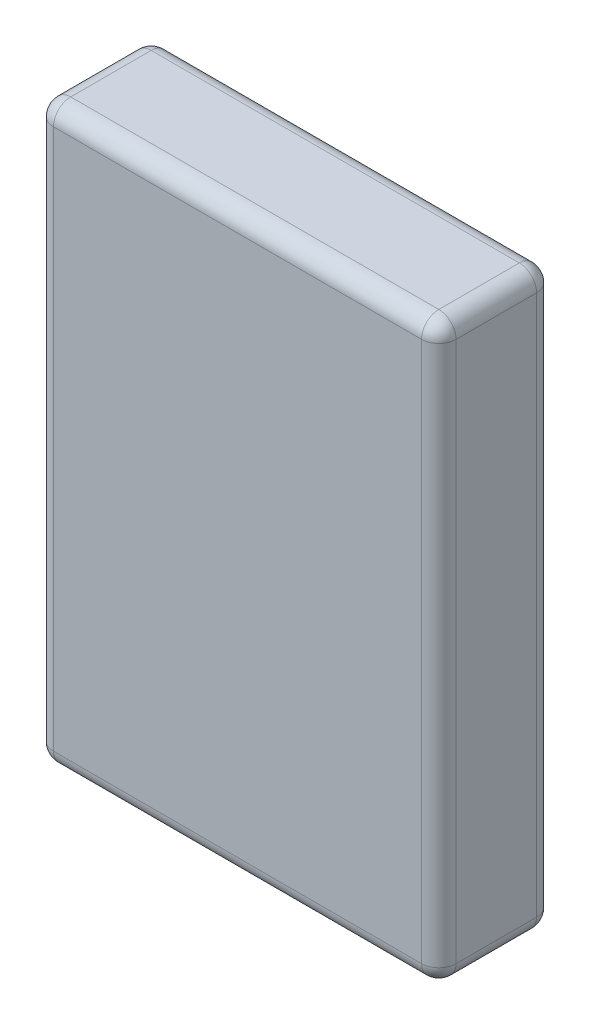
ISO-10303-21;
HEADER;
FILE_DESCRIPTION(('STEP AP214'),'2;1');
FILE_NAME('part.step','',(''),(''),'','','');
FILE_SCHEMA(('AUTOMOTIVE_DESIGN { 1 0 10303 214 1 1 1 1 }'));
ENDSEC;
DATA;
#1=APPLICATION_CONTEXT('core data for automotive mechanical design processes');
#2=APPLICATION_PROTOCOL_DEFINITION('international standard','automotive_design',2000,#1);
#3=PRODUCT_CONTEXT('',#1,'mechanical');
#4=PRODUCT('Part','Part','',(#3));
#5=PRODUCT_RELATED_PRODUCT_CATEGORY('part','',(#4));
#6=PRODUCT_DEFINITION_FORMATION('','',#4);
#7=PRODUCT_DEFINITION_CONTEXT('part definition',#1,'design');
#8=PRODUCT_DEFINITION('design','',#6,#7);
#9=PRODUCT_DEFINITION_SHAPE('','',#8);
#10=(LENGTH_UNIT() NAMED_UNIT(*) SI_UNIT(.MILLI.,.METRE.));
#11=(NAMED_UNIT(*) PLANE_ANGLE_UNIT() SI_UNIT($,.RADIAN.));
#12=(NAMED_UNIT(*) SI_UNIT($,.STERADIAN.) SOLID_ANGLE_UNIT());
#13=UNCERTAINTY_MEASURE_WITH_UNIT(LENGTH_MEASURE(1.E-05),#10,'distance_accuracy_value','');
#14=(GEOMETRIC_REPRESENTATION_CONTEXT(3) GLOBAL_UNCERTAINTY_ASSIGNED_CONTEXT((#13)) GLOBAL_UNIT_ASSIGNED_CONTEXT((#10,
#11,#12)) REPRESENTATION_CONTEXT('',''));
#15=CARTESIAN_POINT('',(0.,0.,0.));
#16=DIRECTION('',(0.,0.,1.));
#17=DIRECTION('',(1.,0.,0.));
#18=AXIS2_PLACEMENT_3D('',#15,#16,#17);
#19=CARTESIAN_POINT('',(0.,0.,20.));
#20=DIRECTION('',(1.,0.,0.));
#21=DIRECTION('',(0.,0.,-1.));
#22=AXIS2_PLACEMENT_3D('',#19,#20,#21);
#23=PLANE('',#22);
#24=DIRECTION('',(0.,-1.,0.));
#25=VECTOR('',#24,1.);
#26=CARTESIAN_POINT('',(0.,0.,17.));
#27=LINE('',#26,#25);
#28=CARTESIAN_POINT('',(0.,3.,17.));
#29=VERTEX_POINT('',#28);
#30=CARTESIAN_POINT('',(0.,97.,17.));
#31=VERTEX_POINT('',#30);
#32=EDGE_CURVE('E186',#29,#31,#27,.F.);
#33=ORIENTED_EDGE('',*,*,#32,.T.);
#34=DIRECTION('',(0.,0.,-1.));
#35=VECTOR('',#34,1.);
#36=CARTESIAN_POINT('',(0.,97.,20.));
#37=LINE('',#36,#35);
#38=CARTESIAN_POINT('',(0.,97.,3.));
#39=VERTEX_POINT('',#38);
#40=EDGE_CURVE('E191',#31,#39,#37,.T.);
#41=ORIENTED_EDGE('',*,*,#40,.T.);
#42=DIRECTION('',(0.,-1.,0.));
#43=VECTOR('',#42,1.);
#44=CARTESIAN_POINT('',(0.,0.,3.));
#45=LINE('',#44,#43);
#46=CARTESIAN_POINT('',(0.,3.,3.));
#47=VERTEX_POINT('',#46);
#48=EDGE_CURVE('E188',#39,#47,#45,.T.);
#49=ORIENTED_EDGE('',*,*,#48,.T.);
#50=DIRECTION('',(0.,0.,-1.));
#51=VECTOR('',#50,1.);
#52=CARTESIAN_POINT('',(0.,3.,20.));
#53=LINE('',#52,#51);
#54=EDGE_CURVE('E184',#47,#29,#53,.F.);
#55=ORIENTED_EDGE('',*,*,#54,.T.);
#56=EDGE_LOOP('',(#33,#41,#49,#55));
#57=FACE_BOUND('',#56,.T.);
#58=ADVANCED_FACE('F32',(#57),#23,.F.);
#59=CARTESIAN_POINT('',(0.,0.,20.));
#60=DIRECTION('',(0.,1.,0.));
#61=DIRECTION('',(0.,0.,1.));
#62=AXIS2_PLACEMENT_3D('',#59,#60,#61);
#63=PLANE('',#62);
#64=DIRECTION('',(1.,0.,0.));
#65=VECTOR('',#64,1.);
#66=CARTESIAN_POINT('',(0.,0.,17.));
#67=LINE('',#66,#65);
#68=CARTESIAN_POINT('',(67.,0.,17.));
#69=VERTEX_POINT('',#68);
#70=CARTESIAN_POINT('',(3.,0.,17.));
#71=VERTEX_POINT('',#70);
#72=EDGE_CURVE('E149',#69,#71,#67,.F.);
#73=ORIENTED_EDGE('',*,*,#72,.T.);
#74=DIRECTION('',(0.,0.,-1.));
#75=VECTOR('',#74,1.);
#76=CARTESIAN_POINT('',(3.,0.,20.));
#77=LINE('',#76,#75);
#78=CARTESIAN_POINT('',(3.,0.,3.));
#79=VERTEX_POINT('',#78);
#80=EDGE_CURVE('E153',#71,#79,#77,.T.);
#81=ORIENTED_EDGE('',*,*,#80,.T.);
#82=DIRECTION('',(1.,0.,0.));
#83=VECTOR('',#82,1.);
#84=CARTESIAN_POINT('',(70.,0.,3.));
#85=LINE('',#84,#83);
#86=CARTESIAN_POINT('',(67.,0.,3.));
#87=VERTEX_POINT('',#86);
#88=EDGE_CURVE('E125',#79,#87,#85,.T.);
#89=ORIENTED_EDGE('',*,*,#88,.T.);
#90=DIRECTION('',(0.,0.,-1.));
#91=VECTOR('',#90,1.);
#92=CARTESIAN_POINT('',(67.,0.,20.));
#93=LINE('',#92,#91);
#94=EDGE_CURVE('E143',#87,#69,#93,.F.);
#95=ORIENTED_EDGE('',*,*,#94,.T.);
#96=EDGE_LOOP('',(#73,#81,#89,#95));
#97=FACE_BOUND('',#96,.T.);
#98=ADVANCED_FACE('F151',(#97),#63,.F.);
#99=CARTESIAN_POINT('',(70.,0.,20.));
#100=DIRECTION('',(-1.,0.,0.));
#101=DIRECTION('',(0.,0.,1.));
#102=AXIS2_PLACEMENT_3D('',#99,#100,#101);
#103=PLANE('',#102);
#104=DIRECTION('',(0.,1.,0.));
#105=VECTOR('',#104,1.);
#106=CARTESIAN_POINT('',(70.,100.,3.));
#107=LINE('',#106,#105);
#108=CARTESIAN_POINT('',(70.,3.,3.));
#109=VERTEX_POINT('',#108);
#110=CARTESIAN_POINT('',(70.,97.,3.));
#111=VERTEX_POINT('',#110);
#112=EDGE_CURVE('E170',#109,#111,#107,.T.);
#113=ORIENTED_EDGE('',*,*,#112,.T.);
#114=DIRECTION('',(0.,0.,-1.));
#115=VECTOR('',#114,1.);
#116=CARTESIAN_POINT('',(70.,97.,20.));
#117=LINE('',#116,#115);
#118=CARTESIAN_POINT('',(70.,97.,17.));
#119=VERTEX_POINT('',#118);
#120=EDGE_CURVE('E173',#111,#119,#117,.F.);
#121=ORIENTED_EDGE('',*,*,#120,.T.);
#122=DIRECTION('',(0.,1.,0.));
#123=VECTOR('',#122,1.);
#124=CARTESIAN_POINT('',(70.,0.,17.));
#125=LINE('',#124,#123);
#126=CARTESIAN_POINT('',(70.,3.,17.));
#127=VERTEX_POINT('',#126);
#128=EDGE_CURVE('E168',#119,#127,#125,.F.);
#129=ORIENTED_EDGE('',*,*,#128,.T.);
#130=DIRECTION('',(0.,0.,-1.));
#131=VECTOR('',#130,1.);
#132=CARTESIAN_POINT('',(70.,3.,20.));
#133=LINE('',#132,#131);
#134=EDGE_CURVE('E166',#127,#109,#133,.T.);
#135=ORIENTED_EDGE('',*,*,#134,.T.);
#136=EDGE_LOOP('',(#113,#121,#129,#135));
#137=FACE_BOUND('',#136,.T.);
#138=ADVANCED_FACE('F326',(#137),#103,.F.);
#139=CARTESIAN_POINT('',(0.,100.,20.));
#140=DIRECTION('',(0.,-1.,0.));
#141=DIRECTION('',(0.,0.,-1.));
#142=AXIS2_PLACEMENT_3D('',#139,#140,#141);
#143=PLANE('',#142);
#144=DIRECTION('',(-1.,0.,0.));
#145=VECTOR('',#144,1.);
#146=CARTESIAN_POINT('',(0.,100.,3.));
#147=LINE('',#146,#145);
#148=CARTESIAN_POINT('',(67.,100.,3.));
#149=VERTEX_POINT('',#148);
#150=CARTESIAN_POINT('',(3.,100.,3.));
#151=VERTEX_POINT('',#150);
#152=EDGE_CURVE('E179',#149,#151,#147,.T.);
#153=ORIENTED_EDGE('',*,*,#152,.T.);
#154=DIRECTION('',(0.,0.,-1.));
#155=VECTOR('',#154,1.);
#156=CARTESIAN_POINT('',(3.,100.,20.));
#157=LINE('',#156,#155);
#158=CARTESIAN_POINT('',(3.,100.,17.));
#159=VERTEX_POINT('',#158);
#160=EDGE_CURVE('E182',#151,#159,#157,.F.);
#161=ORIENTED_EDGE('',*,*,#160,.T.);
#162=DIRECTION('',(-1.,0.,0.));
#163=VECTOR('',#162,1.);
#164=CARTESIAN_POINT('',(0.,100.,17.));
#165=LINE('',#164,#163);
#166=CARTESIAN_POINT('',(67.,100.,17.));
#167=VERTEX_POINT('',#166);
#168=EDGE_CURVE('E177',#159,#167,#165,.F.);
#169=ORIENTED_EDGE('',*,*,#168,.T.);
#170=DIRECTION('',(0.,0.,-1.));
#171=VECTOR('',#170,1.);
#172=CARTESIAN_POINT('',(67.,100.,20.));
#173=LINE('',#172,#171);
#174=EDGE_CURVE('E175',#167,#149,#173,.T.);
#175=ORIENTED_EDGE('',*,*,#174,.T.);
#176=EDGE_LOOP('',(#153,#161,#169,#175));
#177=FACE_BOUND('',#176,.T.);
#178=ADVANCED_FACE('F293',(#177),#143,.F.);
#179=CARTESIAN_POINT('',(0.,0.,20.));
#180=DIRECTION('',(0.,0.,-1.));
#181=DIRECTION('',(-1.,0.,0.));
#182=AXIS2_PLACEMENT_3D('',#179,#180,#181);
#183=PLANE('',#182);
#184=DIRECTION('',(0.,1.,0.));
#185=VECTOR('',#184,1.);
#186=CARTESIAN_POINT('',(67.,0.,20.));
#187=LINE('',#186,#185);
#188=CARTESIAN_POINT('',(67.,3.,20.));
#189=VERTEX_POINT('',#188);
#190=CARTESIAN_POINT('',(67.,97.,20.));
#191=VERTEX_POINT('',#190);
#192=EDGE_CURVE('E41',#189,#191,#187,.T.);
#193=ORIENTED_EDGE('',*,*,#192,.T.);
#194=DIRECTION('',(-1.,0.,0.));
#195=VECTOR('',#194,1.);
#196=CARTESIAN_POINT('',(0.,97.,20.));
#197=LINE('',#196,#195);
#198=CARTESIAN_POINT('',(3.,97.,20.));
#199=VERTEX_POINT('',#198);
#200=EDGE_CURVE('E11',#191,#199,#197,.T.);
#201=ORIENTED_EDGE('',*,*,#200,.T.);
#202=DIRECTION('',(0.,-1.,0.));
#203=VECTOR('',#202,1.);
#204=CARTESIAN_POINT('',(3.,0.,20.));
#205=LINE('',#204,#203);
#206=CARTESIAN_POINT('',(3.,3.,20.));
#207=VERTEX_POINT('',#206);
#208=EDGE_CURVE('E193',#199,#207,#205,.T.);
#209=ORIENTED_EDGE('',*,*,#208,.T.);
#210=DIRECTION('',(1.,0.,0.));
#211=VECTOR('',#210,1.);
#212=CARTESIAN_POINT('',(0.,3.,20.));
#213=LINE('',#212,#211);
#214=EDGE_CURVE('E52',#207,#189,#213,.T.);
#215=ORIENTED_EDGE('',*,*,#214,.T.);
#216=EDGE_LOOP('',(#193,#201,#209,#215));
#217=FACE_BOUND('',#216,.T.);
#218=ADVANCED_FACE('F273',(#217),#183,.F.);
#219=CARTESIAN_POINT('',(0.,0.,0.));
#220=DIRECTION('',(0.,0.,-1.));
#221=DIRECTION('',(-1.,0.,0.));
#222=AXIS2_PLACEMENT_3D('',#219,#220,#221);
#223=PLANE('',#222);
#224=DIRECTION('',(0.,1.,0.));
#225=VECTOR('',#224,1.);
#226=CARTESIAN_POINT('',(67.,0.,0.));
#227=LINE('',#226,#225);
#228=CARTESIAN_POINT('',(67.,97.,0.));
#229=VERTEX_POINT('',#228);
#230=CARTESIAN_POINT('',(67.,3.,0.));
#231=VERTEX_POINT('',#230);
#232=EDGE_CURVE('E163',#229,#231,#227,.F.);
#233=ORIENTED_EDGE('',*,*,#232,.T.);
#234=DIRECTION('',(1.,0.,0.));
#235=VECTOR('',#234,1.);
#236=CARTESIAN_POINT('',(0.,3.,0.));
#237=LINE('',#236,#235);
#238=CARTESIAN_POINT('',(3.,3.,0.));
#239=VERTEX_POINT('',#238);
#240=EDGE_CURVE('E127',#231,#239,#237,.F.);
#241=ORIENTED_EDGE('',*,*,#240,.T.);
#242=DIRECTION('',(0.,-1.,0.));
#243=VECTOR('',#242,1.);
#244=CARTESIAN_POINT('',(3.,100.,0.));
#245=LINE('',#244,#243);
#246=CARTESIAN_POINT('',(3.,97.,0.));
#247=VERTEX_POINT('',#246);
#248=EDGE_CURVE('E156',#239,#247,#245,.F.);
#249=ORIENTED_EDGE('',*,*,#248,.T.);
#250=DIRECTION('',(-1.,0.,0.));
#251=VECTOR('',#250,1.);
#252=CARTESIAN_POINT('',(70.,97.,0.));
#253=LINE('',#252,#251);
#254=EDGE_CURVE('E161',#247,#229,#253,.F.);
#255=ORIENTED_EDGE('',*,*,#254,.T.);
#256=EDGE_LOOP('',(#233,#241,#249,#255));
#257=FACE_BOUND('',#256,.T.);
#258=ADVANCED_FACE('F354',(#257),#223,.T.);
#259=CARTESIAN_POINT('',(0.,97.,17.));
#260=DIRECTION('',(-1.,0.,0.));
#261=DIRECTION('',(0.,0.,1.));
#262=AXIS2_PLACEMENT_3D('',#259,#260,#261);
#263=CYLINDRICAL_SURFACE('',#262,3.);
#264=CARTESIAN_POINT('',(3.,97.,17.));
#265=DIRECTION('',(-1.,0.,0.));
#266=DIRECTION('',(0.,0.,1.));
#267=AXIS2_PLACEMENT_3D('',#264,#265,#266);
#268=CIRCLE('',#267,3.);
#269=EDGE_CURVE('E36',#199,#159,#268,.T.);
#270=ORIENTED_EDGE('',*,*,#269,.F.);
#271=ORIENTED_EDGE('',*,*,#200,.F.);
#272=CARTESIAN_POINT('',(67.,97.,17.));
#273=DIRECTION('',(1.,0.,0.));
#274=DIRECTION('',(0.,0.,-1.));
#275=AXIS2_PLACEMENT_3D('',#272,#273,#274);
#276=CIRCLE('',#275,3.);
#277=EDGE_CURVE('E246',#167,#191,#276,.T.);
#278=ORIENTED_EDGE('',*,*,#277,.F.);
#279=ORIENTED_EDGE('',*,*,#168,.F.);
#280=EDGE_LOOP('',(#270,#271,#278,#279));
#281=FACE_BOUND('',#280,.T.);
#282=ADVANCED_FACE('F34',(#281),#263,.T.);
#283=CARTESIAN_POINT('',(3.,97.,17.));
#284=DIRECTION('',(0.,0.,1.));
#285=DIRECTION('',(1.,0.,0.));
#286=AXIS2_PLACEMENT_3D('',#283,#284,#285);
#287=SPHERICAL_SURFACE('',#286,3.);
#288=CARTESIAN_POINT('',(3.,97.,17.));
#289=DIRECTION('',(0.,1.,0.));
#290=DIRECTION('',(0.,0.,1.));
#291=AXIS2_PLACEMENT_3D('',#288,#289,#290);
#292=CIRCLE('',#291,3.);
#293=EDGE_CURVE('E241',#199,#31,#292,.F.);
#294=ORIENTED_EDGE('',*,*,#293,.F.);
#295=ORIENTED_EDGE('',*,*,#269,.T.);
#296=CARTESIAN_POINT('',(3.,97.,17.));
#297=DIRECTION('',(0.,0.,1.));
#298=DIRECTION('',(1.,0.,0.));
#299=AXIS2_PLACEMENT_3D('',#296,#297,#298);
#300=CIRCLE('',#299,3.);
#301=EDGE_CURVE('E244',#31,#159,#300,.F.);
#302=ORIENTED_EDGE('',*,*,#301,.F.);
#303=EDGE_LOOP('',(#294,#295,#302));
#304=FACE_BOUND('',#303,.T.);
#305=ADVANCED_FACE('F257',(#304),#287,.T.);
#306=CARTESIAN_POINT('',(67.,97.,17.));
#307=DIRECTION('',(0.,0.,1.));
#308=DIRECTION('',(1.,0.,0.));
#309=AXIS2_PLACEMENT_3D('',#306,#307,#308);
#310=SPHERICAL_SURFACE('',#309,3.);
#311=CARTESIAN_POINT('',(67.,97.,17.));
#312=DIRECTION('',(0.,0.,1.));
#313=DIRECTION('',(1.,0.,0.));
#314=AXIS2_PLACEMENT_3D('',#311,#312,#313);
#315=CIRCLE('',#314,3.);
#316=EDGE_CURVE('E235',#167,#119,#315,.F.);
#317=ORIENTED_EDGE('',*,*,#316,.F.);
#318=ORIENTED_EDGE('',*,*,#277,.T.);
#319=CARTESIAN_POINT('',(67.,97.,17.));
#320=DIRECTION('',(0.,1.,0.));
#321=DIRECTION('',(0.,0.,1.));
#322=AXIS2_PLACEMENT_3D('',#319,#320,#321);
#323=CIRCLE('',#322,3.);
#324=EDGE_CURVE('E238',#119,#191,#323,.F.);
#325=ORIENTED_EDGE('',*,*,#324,.F.);
#326=EDGE_LOOP('',(#317,#318,#325));
#327=FACE_BOUND('',#326,.T.);
#328=ADVANCED_FACE('F285',(#327),#310,.T.);
#329=CARTESIAN_POINT('',(3.,97.,20.));
#330=DIRECTION('',(0.,0.,-1.));
#331=DIRECTION('',(-1.,0.,0.));
#332=AXIS2_PLACEMENT_3D('',#329,#330,#331);
#333=CYLINDRICAL_SURFACE('',#332,3.);
#334=ORIENTED_EDGE('',*,*,#301,.T.);
#335=ORIENTED_EDGE('',*,*,#160,.F.);
#336=CARTESIAN_POINT('',(3.,97.,3.));
#337=DIRECTION('',(0.,0.,-1.));
#338=DIRECTION('',(-1.,0.,0.));
#339=AXIS2_PLACEMENT_3D('',#336,#337,#338);
#340=CIRCLE('',#339,3.);
#341=EDGE_CURVE('E230',#39,#151,#340,.T.);
#342=ORIENTED_EDGE('',*,*,#341,.F.);
#343=ORIENTED_EDGE('',*,*,#40,.F.);
#344=EDGE_LOOP('',(#334,#335,#342,#343));
#345=FACE_BOUND('',#344,.T.);
#346=ADVANCED_FACE('F263',(#345),#333,.T.);
#347=CARTESIAN_POINT('',(3.,0.,17.));
#348=DIRECTION('',(0.,-1.,0.));
#349=DIRECTION('',(0.,0.,-1.));
#350=AXIS2_PLACEMENT_3D('',#347,#348,#349);
#351=CYLINDRICAL_SURFACE('',#350,3.);
#352=ORIENTED_EDGE('',*,*,#293,.T.);
#353=ORIENTED_EDGE('',*,*,#32,.F.);
#354=CARTESIAN_POINT('',(3.,3.,17.));
#355=DIRECTION('',(0.,-1.,0.));
#356=DIRECTION('',(0.,0.,-1.));
#357=AXIS2_PLACEMENT_3D('',#354,#355,#356);
#358=CIRCLE('',#357,3.);
#359=EDGE_CURVE('E227',#207,#29,#358,.T.);
#360=ORIENTED_EDGE('',*,*,#359,.F.);
#361=ORIENTED_EDGE('',*,*,#208,.F.);
#362=EDGE_LOOP('',(#352,#353,#360,#361));
#363=FACE_BOUND('',#362,.T.);
#364=ADVANCED_FACE('F272',(#363),#351,.T.);
#365=CARTESIAN_POINT('',(0.,3.,17.));
#366=DIRECTION('',(1.,0.,0.));
#367=DIRECTION('',(0.,0.,-1.));
#368=AXIS2_PLACEMENT_3D('',#365,#366,#367);
#369=CYLINDRICAL_SURFACE('',#368,3.);
#370=CARTESIAN_POINT('',(67.,3.,17.));
#371=DIRECTION('',(1.,0.,0.));
#372=DIRECTION('',(0.,0.,-1.));
#373=AXIS2_PLACEMENT_3D('',#370,#371,#372);
#374=CIRCLE('',#373,3.);
#375=EDGE_CURVE('E221',#189,#69,#374,.T.);
#376=ORIENTED_EDGE('',*,*,#375,.F.);
#377=ORIENTED_EDGE('',*,*,#214,.F.);
#378=CARTESIAN_POINT('',(3.,3.,17.));
#379=DIRECTION('',(-1.,0.,0.));
#380=DIRECTION('',(0.,0.,1.));
#381=AXIS2_PLACEMENT_3D('',#378,#379,#380);
#382=CIRCLE('',#381,3.);
#383=EDGE_CURVE('E224',#71,#207,#382,.T.);
#384=ORIENTED_EDGE('',*,*,#383,.F.);
#385=ORIENTED_EDGE('',*,*,#72,.F.);
#386=EDGE_LOOP('',(#376,#377,#384,#385));
#387=FACE_BOUND('',#386,.T.);
#388=ADVANCED_FACE('F277',(#387),#369,.T.);
#389=CARTESIAN_POINT('',(67.,0.,17.));
#390=DIRECTION('',(0.,1.,0.));
#391=DIRECTION('',(0.,0.,1.));
#392=AXIS2_PLACEMENT_3D('',#389,#390,#391);
#393=CYLINDRICAL_SURFACE('',#392,3.);
#394=ORIENTED_EDGE('',*,*,#324,.T.);
#395=ORIENTED_EDGE('',*,*,#192,.F.);
#396=CARTESIAN_POINT('',(67.,3.,17.));
#397=DIRECTION('',(0.,-1.,0.));
#398=DIRECTION('',(0.,0.,-1.));
#399=AXIS2_PLACEMENT_3D('',#396,#397,#398);
#400=CIRCLE('',#399,3.);
#401=EDGE_CURVE('E218',#127,#189,#400,.T.);
#402=ORIENTED_EDGE('',*,*,#401,.F.);
#403=ORIENTED_EDGE('',*,*,#128,.F.);
#404=EDGE_LOOP('',(#394,#395,#402,#403));
#405=FACE_BOUND('',#404,.T.);
#406=ADVANCED_FACE('F284',(#405),#393,.T.);
#407=CARTESIAN_POINT('',(67.,97.,20.));
#408=DIRECTION('',(0.,0.,-1.));
#409=DIRECTION('',(-1.,0.,0.));
#410=AXIS2_PLACEMENT_3D('',#407,#408,#409);
#411=CYLINDRICAL_SURFACE('',#410,3.);
#412=ORIENTED_EDGE('',*,*,#316,.T.);
#413=ORIENTED_EDGE('',*,*,#120,.F.);
#414=CARTESIAN_POINT('',(67.,97.,3.));
#415=DIRECTION('',(0.,0.,-1.));
#416=DIRECTION('',(-1.,0.,0.));
#417=AXIS2_PLACEMENT_3D('',#414,#415,#416);
#418=CIRCLE('',#417,3.);
#419=EDGE_CURVE('E215',#149,#111,#418,.T.);
#420=ORIENTED_EDGE('',*,*,#419,.F.);
#421=ORIENTED_EDGE('',*,*,#174,.F.);
#422=EDGE_LOOP('',(#412,#413,#420,#421));
#423=FACE_BOUND('',#422,.T.);
#424=ADVANCED_FACE('F290',(#423),#411,.T.);
#425=CARTESIAN_POINT('',(0.,97.,3.));
#426=DIRECTION('',(1.,0.,0.));
#427=DIRECTION('',(0.,0.,-1.));
#428=AXIS2_PLACEMENT_3D('',#425,#426,#427);
#429=CYLINDRICAL_SURFACE('',#428,3.);
#430=CARTESIAN_POINT('',(3.,97.,3.));
#431=DIRECTION('',(-1.,0.,0.));
#432=DIRECTION('',(0.,0.,1.));
#433=AXIS2_PLACEMENT_3D('',#430,#431,#432);
#434=CIRCLE('',#433,3.);
#435=EDGE_CURVE('E232',#151,#247,#434,.T.);
#436=ORIENTED_EDGE('',*,*,#435,.F.);
#437=ORIENTED_EDGE('',*,*,#152,.F.);
#438=CARTESIAN_POINT('',(67.,97.,3.));
#439=DIRECTION('',(1.,0.,0.));
#440=DIRECTION('',(0.,0.,-1.));
#441=AXIS2_PLACEMENT_3D('',#438,#439,#440);
#442=CIRCLE('',#441,3.);
#443=EDGE_CURVE('E212',#229,#149,#442,.T.);
#444=ORIENTED_EDGE('',*,*,#443,.F.);
#445=ORIENTED_EDGE('',*,*,#254,.F.);
#446=EDGE_LOOP('',(#436,#437,#444,#445));
#447=FACE_BOUND('',#446,.T.);
#448=ADVANCED_FACE('F297',(#447),#429,.T.);
#449=CARTESIAN_POINT('',(3.,97.,3.));
#450=DIRECTION('',(0.,0.,1.));
#451=DIRECTION('',(1.,0.,0.));
#452=AXIS2_PLACEMENT_3D('',#449,#450,#451);
#453=SPHERICAL_SURFACE('',#452,3.);
#454=ORIENTED_EDGE('',*,*,#341,.T.);
#455=ORIENTED_EDGE('',*,*,#435,.T.);
#456=CARTESIAN_POINT('',(3.,97.,3.));
#457=DIRECTION('',(0.,1.,0.));
#458=DIRECTION('',(0.,0.,1.));
#459=AXIS2_PLACEMENT_3D('',#456,#457,#458);
#460=CIRCLE('',#459,3.);
#461=EDGE_CURVE('E209',#39,#247,#460,.F.);
#462=ORIENTED_EDGE('',*,*,#461,.F.);
#463=EDGE_LOOP('',(#454,#455,#462));
#464=FACE_BOUND('',#463,.T.);
#465=ADVANCED_FACE('F301',(#464),#453,.T.);
#466=CARTESIAN_POINT('',(3.,3.,17.));
#467=DIRECTION('',(0.,0.,1.));
#468=DIRECTION('',(1.,0.,0.));
#469=AXIS2_PLACEMENT_3D('',#466,#467,#468);
#470=SPHERICAL_SURFACE('',#469,3.);
#471=ORIENTED_EDGE('',*,*,#383,.T.);
#472=ORIENTED_EDGE('',*,*,#359,.T.);
#473=CARTESIAN_POINT('',(3.,3.,17.));
#474=DIRECTION('',(0.,0.,1.));
#475=DIRECTION('',(1.,0.,0.));
#476=AXIS2_PLACEMENT_3D('',#473,#474,#475);
#477=CIRCLE('',#476,3.);
#478=EDGE_CURVE('E206',#71,#29,#477,.F.);
#479=ORIENTED_EDGE('',*,*,#478,.F.);
#480=EDGE_LOOP('',(#471,#472,#479));
#481=FACE_BOUND('',#480,.T.);
#482=ADVANCED_FACE('F311',(#481),#470,.T.);
#483=CARTESIAN_POINT('',(67.,3.,17.));
#484=DIRECTION('',(0.,0.,1.));
#485=DIRECTION('',(1.,0.,0.));
#486=AXIS2_PLACEMENT_3D('',#483,#484,#485);
#487=SPHERICAL_SURFACE('',#486,3.);
#488=ORIENTED_EDGE('',*,*,#401,.T.);
#489=ORIENTED_EDGE('',*,*,#375,.T.);
#490=CARTESIAN_POINT('',(67.,3.,17.));
#491=DIRECTION('',(0.,0.,1.));
#492=DIRECTION('',(1.,0.,0.));
#493=AXIS2_PLACEMENT_3D('',#490,#491,#492);
#494=CIRCLE('',#493,3.);
#495=EDGE_CURVE('E146',#127,#69,#494,.F.);
#496=ORIENTED_EDGE('',*,*,#495,.F.);
#497=EDGE_LOOP('',(#488,#489,#496));
#498=FACE_BOUND('',#497,.T.);
#499=ADVANCED_FACE('F281',(#498),#487,.T.);
#500=CARTESIAN_POINT('',(67.,97.,3.));
#501=DIRECTION('',(0.,0.,1.));
#502=DIRECTION('',(1.,0.,0.));
#503=AXIS2_PLACEMENT_3D('',#500,#501,#502);
#504=SPHERICAL_SURFACE('',#503,3.);
#505=ORIENTED_EDGE('',*,*,#443,.T.);
#506=ORIENTED_EDGE('',*,*,#419,.T.);
#507=CARTESIAN_POINT('',(67.,97.,3.));
#508=DIRECTION('',(0.,1.,0.));
#509=DIRECTION('',(0.,0.,1.));
#510=AXIS2_PLACEMENT_3D('',#507,#508,#509);
#511=CIRCLE('',#510,3.);
#512=EDGE_CURVE('E203',#229,#111,#511,.F.);
#513=ORIENTED_EDGE('',*,*,#512,.F.);
#514=EDGE_LOOP('',(#505,#506,#513));
#515=FACE_BOUND('',#514,.T.);
#516=ADVANCED_FACE('F318',(#515),#504,.T.);
#517=CARTESIAN_POINT('',(3.,0.,3.));
#518=DIRECTION('',(0.,1.,0.));
#519=DIRECTION('',(0.,0.,1.));
#520=AXIS2_PLACEMENT_3D('',#517,#518,#519);
#521=CYLINDRICAL_SURFACE('',#520,3.);
#522=ORIENTED_EDGE('',*,*,#461,.T.);
#523=ORIENTED_EDGE('',*,*,#248,.F.);
#524=CARTESIAN_POINT('',(3.,3.,3.));
#525=DIRECTION('',(0.,-1.,0.));
#526=DIRECTION('',(0.,0.,-1.));
#527=AXIS2_PLACEMENT_3D('',#524,#525,#526);
#528=CIRCLE('',#527,3.);
#529=EDGE_CURVE('E200',#47,#239,#528,.T.);
#530=ORIENTED_EDGE('',*,*,#529,.F.);
#531=ORIENTED_EDGE('',*,*,#48,.F.);
#532=EDGE_LOOP('',(#522,#523,#530,#531));
#533=FACE_BOUND('',#532,.T.);
#534=ADVANCED_FACE('F304',(#533),#521,.T.);
#535=CARTESIAN_POINT('',(3.,3.,20.));
#536=DIRECTION('',(0.,0.,-1.));
#537=DIRECTION('',(-1.,0.,0.));
#538=AXIS2_PLACEMENT_3D('',#535,#536,#537);
#539=CYLINDRICAL_SURFACE('',#538,3.);
#540=ORIENTED_EDGE('',*,*,#478,.T.);
#541=ORIENTED_EDGE('',*,*,#54,.F.);
#542=CARTESIAN_POINT('',(3.,3.,3.));
#543=DIRECTION('',(0.,0.,-1.));
#544=DIRECTION('',(-1.,0.,0.));
#545=AXIS2_PLACEMENT_3D('',#542,#543,#544);
#546=CIRCLE('',#545,3.);
#547=EDGE_CURVE('E140',#79,#47,#546,.T.);
#548=ORIENTED_EDGE('',*,*,#547,.F.);
#549=ORIENTED_EDGE('',*,*,#80,.F.);
#550=EDGE_LOOP('',(#540,#541,#548,#549));
#551=FACE_BOUND('',#550,.T.);
#552=ADVANCED_FACE('F309',(#551),#539,.T.);
#553=CARTESIAN_POINT('',(67.,3.,20.));
#554=DIRECTION('',(0.,0.,-1.));
#555=DIRECTION('',(-1.,0.,0.));
#556=AXIS2_PLACEMENT_3D('',#553,#554,#555);
#557=CYLINDRICAL_SURFACE('',#556,3.);
#558=ORIENTED_EDGE('',*,*,#495,.T.);
#559=ORIENTED_EDGE('',*,*,#94,.F.);
#560=CARTESIAN_POINT('',(67.,3.,3.));
#561=DIRECTION('',(0.,0.,-1.));
#562=DIRECTION('',(-1.,0.,0.));
#563=AXIS2_PLACEMENT_3D('',#560,#561,#562);
#564=CIRCLE('',#563,3.);
#565=EDGE_CURVE('E133',#109,#87,#564,.T.);
#566=ORIENTED_EDGE('',*,*,#565,.F.);
#567=ORIENTED_EDGE('',*,*,#134,.F.);
#568=EDGE_LOOP('',(#558,#559,#566,#567));
#569=FACE_BOUND('',#568,.T.);
#570=ADVANCED_FACE('F144',(#569),#557,.T.);
#571=CARTESIAN_POINT('',(67.,0.,3.));
#572=DIRECTION('',(0.,-1.,0.));
#573=DIRECTION('',(0.,0.,-1.));
#574=AXIS2_PLACEMENT_3D('',#571,#572,#573);
#575=CYLINDRICAL_SURFACE('',#574,3.);
#576=ORIENTED_EDGE('',*,*,#512,.T.);
#577=ORIENTED_EDGE('',*,*,#112,.F.);
#578=CARTESIAN_POINT('',(67.,3.,3.));
#579=DIRECTION('',(0.,-1.,0.));
#580=DIRECTION('',(0.,0.,-1.));
#581=AXIS2_PLACEMENT_3D('',#578,#579,#580);
#582=CIRCLE('',#581,3.);
#583=EDGE_CURVE('E137',#231,#109,#582,.T.);
#584=ORIENTED_EDGE('',*,*,#583,.F.);
#585=ORIENTED_EDGE('',*,*,#232,.F.);
#586=EDGE_LOOP('',(#576,#577,#584,#585));
#587=FACE_BOUND('',#586,.T.);
#588=ADVANCED_FACE('F337',(#587),#575,.T.);
#589=CARTESIAN_POINT('',(3.,3.,3.));
#590=DIRECTION('',(0.,0.,1.));
#591=DIRECTION('',(1.,0.,0.));
#592=AXIS2_PLACEMENT_3D('',#589,#590,#591);
#593=SPHERICAL_SURFACE('',#592,3.);
#594=ORIENTED_EDGE('',*,*,#547,.T.);
#595=ORIENTED_EDGE('',*,*,#529,.T.);
#596=CARTESIAN_POINT('',(3.,3.,3.));
#597=DIRECTION('',(-1.,0.,0.));
#598=DIRECTION('',(0.,0.,1.));
#599=AXIS2_PLACEMENT_3D('',#596,#597,#598);
#600=CIRCLE('',#599,3.);
#601=EDGE_CURVE('E130',#79,#239,#600,.F.);
#602=ORIENTED_EDGE('',*,*,#601,.F.);
#603=EDGE_LOOP('',(#594,#595,#602));
#604=FACE_BOUND('',#603,.T.);
#605=ADVANCED_FACE('F334',(#604),#593,.T.);
#606=CARTESIAN_POINT('',(67.,3.,3.));
#607=DIRECTION('',(0.,0.,1.));
#608=DIRECTION('',(1.,0.,0.));
#609=AXIS2_PLACEMENT_3D('',#606,#607,#608);
#610=SPHERICAL_SURFACE('',#609,3.);
#611=ORIENTED_EDGE('',*,*,#583,.T.);
#612=ORIENTED_EDGE('',*,*,#565,.T.);
#613=CARTESIAN_POINT('',(67.,3.,3.));
#614=DIRECTION('',(1.,0.,0.));
#615=DIRECTION('',(0.,0.,-1.));
#616=AXIS2_PLACEMENT_3D('',#613,#614,#615);
#617=CIRCLE('',#616,3.);
#618=EDGE_CURVE('E121',#231,#87,#617,.F.);
#619=ORIENTED_EDGE('',*,*,#618,.F.);
#620=EDGE_LOOP('',(#611,#612,#619));
#621=FACE_BOUND('',#620,.T.);
#622=ADVANCED_FACE('F135',(#621),#610,.T.);
#623=CARTESIAN_POINT('',(0.,3.,3.));
#624=DIRECTION('',(-1.,0.,0.));
#625=DIRECTION('',(0.,0.,1.));
#626=AXIS2_PLACEMENT_3D('',#623,#624,#625);
#627=CYLINDRICAL_SURFACE('',#626,3.);
#628=ORIENTED_EDGE('',*,*,#601,.T.);
#629=ORIENTED_EDGE('',*,*,#240,.F.);
#630=ORIENTED_EDGE('',*,*,#618,.T.);
#631=ORIENTED_EDGE('',*,*,#88,.F.);
#632=EDGE_LOOP('',(#628,#629,#630,#631));
#633=FACE_BOUND('',#632,.T.);
#634=ADVANCED_FACE('F123',(#633),#627,.T.);
#635=CLOSED_SHELL('',(#58,#98,#138,#178,#218,#258,#282,#305,#328,#346,#364,#388,#406,#424,#448,
#465,#482,#499,#516,#534,#552,#570,#588,#605,#622,#634));
#636=MANIFOLD_SOLID_BREP('B2',#635);
#637=ADVANCED_BREP_SHAPE_REPRESENTATION('',(#18,#636),#14);
#638=SHAPE_DEFINITION_REPRESENTATION(#9,#637);
ENDSEC;
END-ISO-10303-21;
